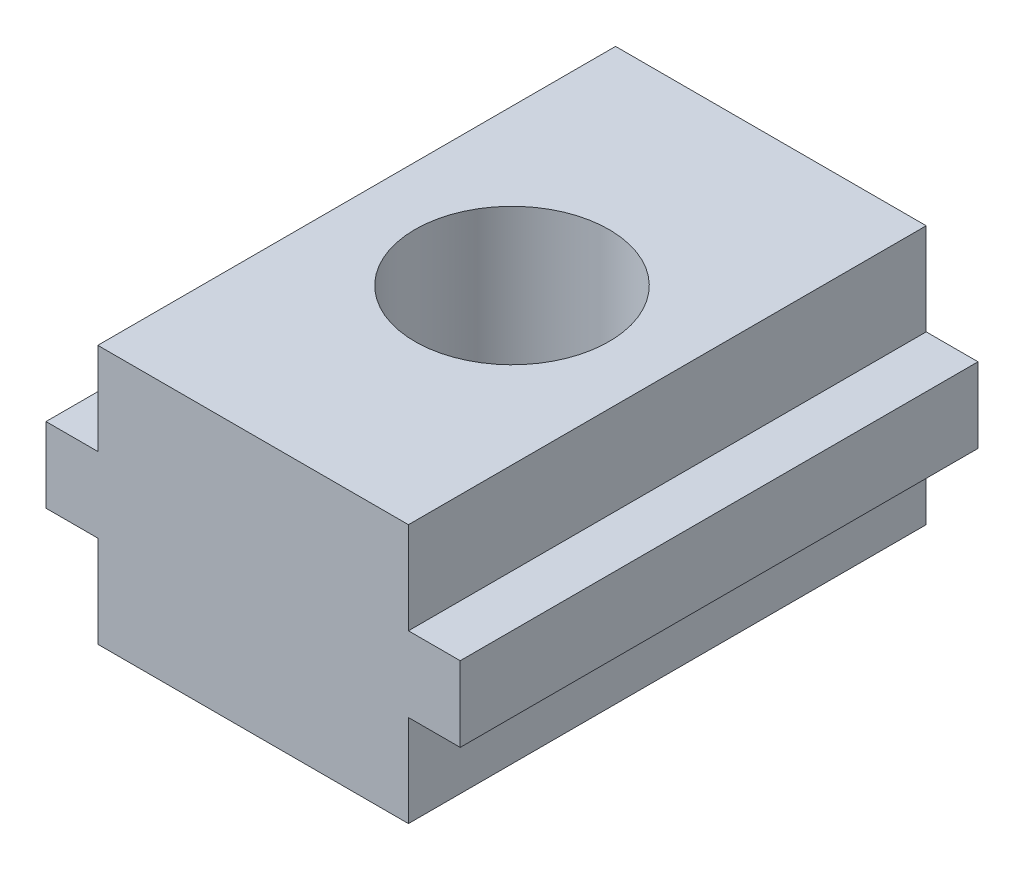
ISO-10303-21;
HEADER;
FILE_DESCRIPTION(('STEP AP214'),'2;1');
FILE_NAME('part.step','',(''),(''),'','','');
FILE_SCHEMA(('AUTOMOTIVE_DESIGN { 1 0 10303 214 1 1 1 1 }'));
ENDSEC;
DATA;
#1=APPLICATION_CONTEXT('core data for automotive mechanical design processes');
#2=APPLICATION_PROTOCOL_DEFINITION('international standard','automotive_design',2000,#1);
#3=PRODUCT_CONTEXT('',#1,'mechanical');
#4=PRODUCT('Part','Part','',(#3));
#5=PRODUCT_RELATED_PRODUCT_CATEGORY('part','',(#4));
#6=PRODUCT_DEFINITION_FORMATION('','',#4);
#7=PRODUCT_DEFINITION_CONTEXT('part definition',#1,'design');
#8=PRODUCT_DEFINITION('design','',#6,#7);
#9=PRODUCT_DEFINITION_SHAPE('','',#8);
#10=(LENGTH_UNIT() NAMED_UNIT(*) SI_UNIT(.MILLI.,.METRE.));
#11=(NAMED_UNIT(*) PLANE_ANGLE_UNIT() SI_UNIT($,.RADIAN.));
#12=(NAMED_UNIT(*) SI_UNIT($,.STERADIAN.) SOLID_ANGLE_UNIT());
#13=UNCERTAINTY_MEASURE_WITH_UNIT(LENGTH_MEASURE(1.E-05),#10,'distance_accuracy_value','');
#14=(GEOMETRIC_REPRESENTATION_CONTEXT(3) GLOBAL_UNCERTAINTY_ASSIGNED_CONTEXT((#13)) GLOBAL_UNIT_ASSIGNED_CONTEXT((#10,
#11,#12)) REPRESENTATION_CONTEXT('',''));
#15=CARTESIAN_POINT('',(0.,0.,0.));
#16=DIRECTION('',(0.,0.,1.));
#17=DIRECTION('',(1.,0.,0.));
#18=AXIS2_PLACEMENT_3D('',#15,#16,#17);
#19=CARTESIAN_POINT('',(6.,10.,10.));
#20=DIRECTION('',(0.,-1.,0.));
#21=DIRECTION('',(1.,0.,0.));
#22=AXIS2_PLACEMENT_3D('',#19,#20,#21);
#23=PLANE('',#22);
#24=CARTESIAN_POINT('',(0.,10.,0.));
#25=DIRECTION('',(0.,1.,0.));
#26=DIRECTION('',(-1.,0.,0.));
#27=AXIS2_PLACEMENT_3D('',#24,#25,#26);
#28=CIRCLE('',#27,3.75);
#29=CARTESIAN_POINT('',(-3.75,10.,0.));
#30=VERTEX_POINT('',#29);
#31=EDGE_CURVE('E261',#30,#30,#28,.T.);
#32=ORIENTED_EDGE('',*,*,#31,.F.);
#33=EDGE_LOOP('',(#32));
#34=FACE_BOUND('',#33,.T.);
#35=DIRECTION('',(-1.,0.,0.));
#36=VECTOR('',#35,1.);
#37=CARTESIAN_POINT('',(6.,10.,-10.));
#38=LINE('',#37,#36);
#39=CARTESIAN_POINT('',(6.,10.,-10.));
#40=VERTEX_POINT('',#39);
#41=CARTESIAN_POINT('',(-6.,10.,-10.));
#42=VERTEX_POINT('',#41);
#43=EDGE_CURVE('E153',#40,#42,#38,.T.);
#44=ORIENTED_EDGE('',*,*,#43,.T.);
#45=DIRECTION('',(0.,0.,-1.));
#46=VECTOR('',#45,1.);
#47=CARTESIAN_POINT('',(-6.,10.,10.));
#48=LINE('',#47,#46);
#49=CARTESIAN_POINT('',(-6.,10.,10.));
#50=VERTEX_POINT('',#49);
#51=EDGE_CURVE('E11',#50,#42,#48,.T.);
#52=ORIENTED_EDGE('',*,*,#51,.F.);
#53=DIRECTION('',(-1.,0.,0.));
#54=VECTOR('',#53,1.);
#55=CARTESIAN_POINT('',(6.,10.,10.));
#56=LINE('',#55,#54);
#57=CARTESIAN_POINT('',(6.,10.,10.));
#58=VERTEX_POINT('',#57);
#59=EDGE_CURVE('E176',#58,#50,#56,.T.);
#60=ORIENTED_EDGE('',*,*,#59,.F.);
#61=DIRECTION('',(0.,0.,-1.));
#62=VECTOR('',#61,1.);
#63=CARTESIAN_POINT('',(6.,10.,10.));
#64=LINE('',#63,#62);
#65=EDGE_CURVE('E149',#58,#40,#64,.T.);
#66=ORIENTED_EDGE('',*,*,#65,.T.);
#67=EDGE_LOOP('',(#44,#52,#60,#66));
#68=FACE_BOUND('',#67,.T.);
#69=ADVANCED_FACE('F33',(#34,#68),#23,.F.);
#70=CARTESIAN_POINT('',(-6.,10.,10.));
#71=DIRECTION('',(1.,0.,0.));
#72=DIRECTION('',(0.,0.,-1.));
#73=AXIS2_PLACEMENT_3D('',#70,#71,#72);
#74=PLANE('',#73);
#75=DIRECTION('',(0.,-1.,0.));
#76=VECTOR('',#75,1.);
#77=CARTESIAN_POINT('',(-6.,10.,-10.));
#78=LINE('',#77,#76);
#79=CARTESIAN_POINT('',(-6.,6.45,-10.));
#80=VERTEX_POINT('',#79);
#81=EDGE_CURVE('E156',#42,#80,#78,.T.);
#82=ORIENTED_EDGE('',*,*,#81,.T.);
#83=DIRECTION('',(0.,0.,-1.));
#84=VECTOR('',#83,1.);
#85=CARTESIAN_POINT('',(-6.,6.45,10.));
#86=LINE('',#85,#84);
#87=CARTESIAN_POINT('',(-6.,6.45,10.));
#88=VERTEX_POINT('',#87);
#89=EDGE_CURVE('E41',#88,#80,#86,.T.);
#90=ORIENTED_EDGE('',*,*,#89,.F.);
#91=DIRECTION('',(0.,-1.,0.));
#92=VECTOR('',#91,1.);
#93=CARTESIAN_POINT('',(-6.,10.,10.));
#94=LINE('',#93,#92);
#95=EDGE_CURVE('E104',#50,#88,#94,.T.);
#96=ORIENTED_EDGE('',*,*,#95,.F.);
#97=ORIENTED_EDGE('',*,*,#51,.T.);
#98=EDGE_LOOP('',(#82,#90,#96,#97));
#99=FACE_BOUND('',#98,.T.);
#100=ADVANCED_FACE('F254',(#99),#74,.F.);
#101=CARTESIAN_POINT('',(-6.,6.45,10.));
#102=DIRECTION('',(0.,-1.,0.));
#103=DIRECTION('',(0.,0.,-1.));
#104=AXIS2_PLACEMENT_3D('',#101,#102,#103);
#105=PLANE('',#104);
#106=DIRECTION('',(-1.,0.,0.));
#107=VECTOR('',#106,1.);
#108=CARTESIAN_POINT('',(-6.,6.45,-10.));
#109=LINE('',#108,#107);
#110=CARTESIAN_POINT('',(-8.,6.45,-10.));
#111=VERTEX_POINT('',#110);
#112=EDGE_CURVE('E159',#80,#111,#109,.T.);
#113=ORIENTED_EDGE('',*,*,#112,.T.);
#114=DIRECTION('',(0.,0.,-1.));
#115=VECTOR('',#114,1.);
#116=CARTESIAN_POINT('',(-8.,6.45,10.));
#117=LINE('',#116,#115);
#118=CARTESIAN_POINT('',(-8.,6.45,10.));
#119=VERTEX_POINT('',#118);
#120=EDGE_CURVE('E195',#119,#111,#117,.T.);
#121=ORIENTED_EDGE('',*,*,#120,.F.);
#122=DIRECTION('',(-1.,0.,0.));
#123=VECTOR('',#122,1.);
#124=CARTESIAN_POINT('',(-6.,6.45,10.));
#125=LINE('',#124,#123);
#126=EDGE_CURVE('E203',#88,#119,#125,.T.);
#127=ORIENTED_EDGE('',*,*,#126,.F.);
#128=ORIENTED_EDGE('',*,*,#89,.T.);
#129=EDGE_LOOP('',(#113,#121,#127,#128));
#130=FACE_BOUND('',#129,.T.);
#131=ADVANCED_FACE('F201',(#130),#105,.F.);
#132=CARTESIAN_POINT('',(-8.,6.45,10.));
#133=DIRECTION('',(1.,0.,0.));
#134=DIRECTION('',(0.,0.,-1.));
#135=AXIS2_PLACEMENT_3D('',#132,#133,#134);
#136=PLANE('',#135);
#137=DIRECTION('',(0.,-1.,0.));
#138=VECTOR('',#137,1.);
#139=CARTESIAN_POINT('',(-8.,6.45,-10.));
#140=LINE('',#139,#138);
#141=CARTESIAN_POINT('',(-8.,3.55,-10.));
#142=VERTEX_POINT('',#141);
#143=EDGE_CURVE('E161',#111,#142,#140,.T.);
#144=ORIENTED_EDGE('',*,*,#143,.T.);
#145=DIRECTION('',(0.,0.,-1.));
#146=VECTOR('',#145,1.);
#147=CARTESIAN_POINT('',(-8.,3.55,10.));
#148=LINE('',#147,#146);
#149=CARTESIAN_POINT('',(-8.,3.55,10.));
#150=VERTEX_POINT('',#149);
#151=EDGE_CURVE('E192',#150,#142,#148,.T.);
#152=ORIENTED_EDGE('',*,*,#151,.F.);
#153=DIRECTION('',(0.,-1.,0.));
#154=VECTOR('',#153,1.);
#155=CARTESIAN_POINT('',(-8.,6.45,10.));
#156=LINE('',#155,#154);
#157=EDGE_CURVE('E221',#119,#150,#156,.T.);
#158=ORIENTED_EDGE('',*,*,#157,.F.);
#159=ORIENTED_EDGE('',*,*,#120,.T.);
#160=EDGE_LOOP('',(#144,#152,#158,#159));
#161=FACE_BOUND('',#160,.T.);
#162=ADVANCED_FACE('F212',(#161),#136,.F.);
#163=CARTESIAN_POINT('',(-8.,3.55,10.));
#164=DIRECTION('',(0.,1.,0.));
#165=DIRECTION('',(0.,0.,1.));
#166=AXIS2_PLACEMENT_3D('',#163,#164,#165);
#167=PLANE('',#166);
#168=DIRECTION('',(1.,0.,0.));
#169=VECTOR('',#168,1.);
#170=CARTESIAN_POINT('',(-8.,3.55,-10.));
#171=LINE('',#170,#169);
#172=CARTESIAN_POINT('',(-6.,3.55,-10.));
#173=VERTEX_POINT('',#172);
#174=EDGE_CURVE('E163',#142,#173,#171,.T.);
#175=ORIENTED_EDGE('',*,*,#174,.T.);
#176=DIRECTION('',(0.,0.,-1.));
#177=VECTOR('',#176,1.);
#178=CARTESIAN_POINT('',(-6.,3.55,10.));
#179=LINE('',#178,#177);
#180=CARTESIAN_POINT('',(-6.,3.55,10.));
#181=VERTEX_POINT('',#180);
#182=EDGE_CURVE('E189',#181,#173,#179,.T.);
#183=ORIENTED_EDGE('',*,*,#182,.F.);
#184=DIRECTION('',(1.,0.,0.));
#185=VECTOR('',#184,1.);
#186=CARTESIAN_POINT('',(-8.,3.55,10.));
#187=LINE('',#186,#185);
#188=EDGE_CURVE('E218',#150,#181,#187,.T.);
#189=ORIENTED_EDGE('',*,*,#188,.F.);
#190=ORIENTED_EDGE('',*,*,#151,.T.);
#191=EDGE_LOOP('',(#175,#183,#189,#190));
#192=FACE_BOUND('',#191,.T.);
#193=ADVANCED_FACE('F216',(#192),#167,.F.);
#194=CARTESIAN_POINT('',(-6.,3.55,10.));
#195=DIRECTION('',(1.,0.,0.));
#196=DIRECTION('',(0.,0.,-1.));
#197=AXIS2_PLACEMENT_3D('',#194,#195,#196);
#198=PLANE('',#197);
#199=DIRECTION('',(0.,-1.,0.));
#200=VECTOR('',#199,1.);
#201=CARTESIAN_POINT('',(-6.,3.55,-10.));
#202=LINE('',#201,#200);
#203=CARTESIAN_POINT('',(-6.,0.,-10.));
#204=VERTEX_POINT('',#203);
#205=EDGE_CURVE('E165',#173,#204,#202,.T.);
#206=ORIENTED_EDGE('',*,*,#205,.T.);
#207=DIRECTION('',(0.,0.,-1.));
#208=VECTOR('',#207,1.);
#209=CARTESIAN_POINT('',(-6.,0.,10.));
#210=LINE('',#209,#208);
#211=CARTESIAN_POINT('',(-6.,0.,10.));
#212=VERTEX_POINT('',#211);
#213=EDGE_CURVE('E186',#212,#204,#210,.T.);
#214=ORIENTED_EDGE('',*,*,#213,.F.);
#215=DIRECTION('',(0.,-1.,0.));
#216=VECTOR('',#215,1.);
#217=CARTESIAN_POINT('',(-6.,3.55,10.));
#218=LINE('',#217,#216);
#219=EDGE_CURVE('E220',#181,#212,#218,.T.);
#220=ORIENTED_EDGE('',*,*,#219,.F.);
#221=ORIENTED_EDGE('',*,*,#182,.T.);
#222=EDGE_LOOP('',(#206,#214,#220,#221));
#223=FACE_BOUND('',#222,.T.);
#224=ADVANCED_FACE('F300',(#223),#198,.F.);
#225=CARTESIAN_POINT('',(-6.,0.,10.));
#226=DIRECTION('',(0.,1.,0.));
#227=DIRECTION('',(-1.,0.,0.));
#228=AXIS2_PLACEMENT_3D('',#225,#226,#227);
#229=PLANE('',#228);
#230=CARTESIAN_POINT('',(0.,0.,0.));
#231=DIRECTION('',(0.,1.,0.));
#232=DIRECTION('',(-1.,0.,0.));
#233=AXIS2_PLACEMENT_3D('',#230,#231,#232);
#234=CIRCLE('',#233,3.);
#235=CARTESIAN_POINT('',(-3.,0.,0.));
#236=VERTEX_POINT('',#235);
#237=EDGE_CURVE('E263',#236,#236,#234,.T.);
#238=ORIENTED_EDGE('',*,*,#237,.T.);
#239=EDGE_LOOP('',(#238));
#240=FACE_BOUND('',#239,.T.);
#241=DIRECTION('',(1.,0.,0.));
#242=VECTOR('',#241,1.);
#243=CARTESIAN_POINT('',(-6.,0.,-10.));
#244=LINE('',#243,#242);
#245=CARTESIAN_POINT('',(6.,0.,-10.));
#246=VERTEX_POINT('',#245);
#247=EDGE_CURVE('E167',#204,#246,#244,.T.);
#248=ORIENTED_EDGE('',*,*,#247,.T.);
#249=DIRECTION('',(0.,0.,-1.));
#250=VECTOR('',#249,1.);
#251=CARTESIAN_POINT('',(6.,0.,10.));
#252=LINE('',#251,#250);
#253=CARTESIAN_POINT('',(6.,0.,10.));
#254=VERTEX_POINT('',#253);
#255=EDGE_CURVE('E183',#254,#246,#252,.T.);
#256=ORIENTED_EDGE('',*,*,#255,.F.);
#257=DIRECTION('',(1.,0.,0.));
#258=VECTOR('',#257,1.);
#259=CARTESIAN_POINT('',(-6.,0.,10.));
#260=LINE('',#259,#258);
#261=EDGE_CURVE('E223',#212,#254,#260,.T.);
#262=ORIENTED_EDGE('',*,*,#261,.F.);
#263=ORIENTED_EDGE('',*,*,#213,.T.);
#264=EDGE_LOOP('',(#248,#256,#262,#263));
#265=FACE_BOUND('',#264,.T.);
#266=ADVANCED_FACE('F297',(#240,#265),#229,.F.);
#267=CARTESIAN_POINT('',(6.,0.,10.));
#268=DIRECTION('',(-1.,0.,0.));
#269=DIRECTION('',(0.,-1.,0.));
#270=AXIS2_PLACEMENT_3D('',#267,#268,#269);
#271=PLANE('',#270);
#272=DIRECTION('',(0.,1.,0.));
#273=VECTOR('',#272,1.);
#274=CARTESIAN_POINT('',(6.,0.,-10.));
#275=LINE('',#274,#273);
#276=CARTESIAN_POINT('',(6.,3.55,-10.));
#277=VERTEX_POINT('',#276);
#278=EDGE_CURVE('E169',#246,#277,#275,.T.);
#279=ORIENTED_EDGE('',*,*,#278,.T.);
#280=DIRECTION('',(0.,0.,-1.));
#281=VECTOR('',#280,1.);
#282=CARTESIAN_POINT('',(6.,3.55,10.));
#283=LINE('',#282,#281);
#284=CARTESIAN_POINT('',(6.,3.55,10.));
#285=VERTEX_POINT('',#284);
#286=EDGE_CURVE('E180',#285,#277,#283,.T.);
#287=ORIENTED_EDGE('',*,*,#286,.F.);
#288=DIRECTION('',(0.,1.,0.));
#289=VECTOR('',#288,1.);
#290=CARTESIAN_POINT('',(6.,0.,10.));
#291=LINE('',#290,#289);
#292=EDGE_CURVE('E229',#254,#285,#291,.T.);
#293=ORIENTED_EDGE('',*,*,#292,.F.);
#294=ORIENTED_EDGE('',*,*,#255,.T.);
#295=EDGE_LOOP('',(#279,#287,#293,#294));
#296=FACE_BOUND('',#295,.T.);
#297=ADVANCED_FACE('F235',(#296),#271,.F.);
#298=CARTESIAN_POINT('',(6.,3.55,10.));
#299=DIRECTION('',(0.,1.,0.));
#300=DIRECTION('',(-1.,0.,0.));
#301=AXIS2_PLACEMENT_3D('',#298,#299,#300);
#302=PLANE('',#301);
#303=DIRECTION('',(1.,0.,0.));
#304=VECTOR('',#303,1.);
#305=CARTESIAN_POINT('',(6.,3.55,-10.));
#306=LINE('',#305,#304);
#307=CARTESIAN_POINT('',(8.,3.55,-10.));
#308=VERTEX_POINT('',#307);
#309=EDGE_CURVE('E171',#277,#308,#306,.T.);
#310=ORIENTED_EDGE('',*,*,#309,.T.);
#311=DIRECTION('',(0.,0.,-1.));
#312=VECTOR('',#311,1.);
#313=CARTESIAN_POINT('',(8.,3.55,10.));
#314=LINE('',#313,#312);
#315=CARTESIAN_POINT('',(8.,3.55,10.));
#316=VERTEX_POINT('',#315);
#317=EDGE_CURVE('E144',#316,#308,#314,.T.);
#318=ORIENTED_EDGE('',*,*,#317,.F.);
#319=DIRECTION('',(1.,0.,0.));
#320=VECTOR('',#319,1.);
#321=CARTESIAN_POINT('',(6.,3.55,10.));
#322=LINE('',#321,#320);
#323=EDGE_CURVE('E135',#285,#316,#322,.T.);
#324=ORIENTED_EDGE('',*,*,#323,.F.);
#325=ORIENTED_EDGE('',*,*,#286,.T.);
#326=EDGE_LOOP('',(#310,#318,#324,#325));
#327=FACE_BOUND('',#326,.T.);
#328=ADVANCED_FACE('F239',(#327),#302,.F.);
#329=CARTESIAN_POINT('',(8.,3.55,10.));
#330=DIRECTION('',(-1.,0.,0.));
#331=DIRECTION('',(0.,-1.,0.));
#332=AXIS2_PLACEMENT_3D('',#329,#330,#331);
#333=PLANE('',#332);
#334=DIRECTION('',(0.,1.,0.));
#335=VECTOR('',#334,1.);
#336=CARTESIAN_POINT('',(8.,3.55,-10.));
#337=LINE('',#336,#335);
#338=CARTESIAN_POINT('',(8.,6.45,-10.));
#339=VERTEX_POINT('',#338);
#340=EDGE_CURVE('E143',#308,#339,#337,.T.);
#341=ORIENTED_EDGE('',*,*,#340,.T.);
#342=DIRECTION('',(0.,0.,-1.));
#343=VECTOR('',#342,1.);
#344=CARTESIAN_POINT('',(8.,6.45,10.));
#345=LINE('',#344,#343);
#346=CARTESIAN_POINT('',(8.,6.45,10.));
#347=VERTEX_POINT('',#346);
#348=EDGE_CURVE('E140',#347,#339,#345,.T.);
#349=ORIENTED_EDGE('',*,*,#348,.F.);
#350=DIRECTION('',(0.,1.,0.));
#351=VECTOR('',#350,1.);
#352=CARTESIAN_POINT('',(8.,3.55,10.));
#353=LINE('',#352,#351);
#354=EDGE_CURVE('E129',#316,#347,#353,.T.);
#355=ORIENTED_EDGE('',*,*,#354,.F.);
#356=ORIENTED_EDGE('',*,*,#317,.T.);
#357=EDGE_LOOP('',(#341,#349,#355,#356));
#358=FACE_BOUND('',#357,.T.);
#359=ADVANCED_FACE('F141',(#358),#333,.F.);
#360=CARTESIAN_POINT('',(8.,6.45,10.));
#361=DIRECTION('',(0.,-1.,0.));
#362=DIRECTION('',(0.,0.,-1.));
#363=AXIS2_PLACEMENT_3D('',#360,#361,#362);
#364=PLANE('',#363);
#365=DIRECTION('',(-1.,0.,0.));
#366=VECTOR('',#365,1.);
#367=CARTESIAN_POINT('',(8.,6.45,-10.));
#368=LINE('',#367,#366);
#369=CARTESIAN_POINT('',(6.,6.45,-10.));
#370=VERTEX_POINT('',#369);
#371=EDGE_CURVE('E90',#339,#370,#368,.T.);
#372=ORIENTED_EDGE('',*,*,#371,.T.);
#373=DIRECTION('',(0.,0.,-1.));
#374=VECTOR('',#373,1.);
#375=CARTESIAN_POINT('',(6.,6.45,10.));
#376=LINE('',#375,#374);
#377=CARTESIAN_POINT('',(6.,6.45,10.));
#378=VERTEX_POINT('',#377);
#379=EDGE_CURVE('E145',#378,#370,#376,.T.);
#380=ORIENTED_EDGE('',*,*,#379,.F.);
#381=DIRECTION('',(-1.,0.,0.));
#382=VECTOR('',#381,1.);
#383=CARTESIAN_POINT('',(8.,6.45,10.));
#384=LINE('',#383,#382);
#385=EDGE_CURVE('E133',#347,#378,#384,.T.);
#386=ORIENTED_EDGE('',*,*,#385,.F.);
#387=ORIENTED_EDGE('',*,*,#348,.T.);
#388=EDGE_LOOP('',(#372,#380,#386,#387));
#389=FACE_BOUND('',#388,.T.);
#390=ADVANCED_FACE('F147',(#389),#364,.F.);
#391=CARTESIAN_POINT('',(6.,6.45,10.));
#392=DIRECTION('',(-1.,0.,0.));
#393=DIRECTION('',(0.,-1.,0.));
#394=AXIS2_PLACEMENT_3D('',#391,#392,#393);
#395=PLANE('',#394);
#396=DIRECTION('',(0.,1.,0.));
#397=VECTOR('',#396,1.);
#398=CARTESIAN_POINT('',(6.,6.45,-10.));
#399=LINE('',#398,#397);
#400=EDGE_CURVE('E96',#370,#40,#399,.T.);
#401=ORIENTED_EDGE('',*,*,#400,.T.);
#402=ORIENTED_EDGE('',*,*,#65,.F.);
#403=DIRECTION('',(0.,1.,0.));
#404=VECTOR('',#403,1.);
#405=CARTESIAN_POINT('',(6.,6.45,10.));
#406=LINE('',#405,#404);
#407=EDGE_CURVE('E49',#378,#58,#406,.T.);
#408=ORIENTED_EDGE('',*,*,#407,.F.);
#409=ORIENTED_EDGE('',*,*,#379,.T.);
#410=EDGE_LOOP('',(#401,#402,#408,#409));
#411=FACE_BOUND('',#410,.T.);
#412=ADVANCED_FACE('F243',(#411),#395,.F.);
#413=CARTESIAN_POINT('',(0.,0.,10.));
#414=DIRECTION('',(0.,0.,1.));
#415=DIRECTION('',(1.,0.,0.));
#416=AXIS2_PLACEMENT_3D('',#413,#414,#415);
#417=PLANE('',#416);
#418=ORIENTED_EDGE('',*,*,#59,.T.);
#419=ORIENTED_EDGE('',*,*,#95,.T.);
#420=ORIENTED_EDGE('',*,*,#126,.T.);
#421=ORIENTED_EDGE('',*,*,#157,.T.);
#422=ORIENTED_EDGE('',*,*,#188,.T.);
#423=ORIENTED_EDGE('',*,*,#219,.T.);
#424=ORIENTED_EDGE('',*,*,#261,.T.);
#425=ORIENTED_EDGE('',*,*,#292,.T.);
#426=ORIENTED_EDGE('',*,*,#323,.T.);
#427=ORIENTED_EDGE('',*,*,#354,.T.);
#428=ORIENTED_EDGE('',*,*,#385,.T.);
#429=ORIENTED_EDGE('',*,*,#407,.T.);
#430=EDGE_LOOP('',(#418,#419,#420,#421,#422,#423,#424,#425,#426,#427,#428,#429));
#431=FACE_BOUND('',#430,.T.);
#432=ADVANCED_FACE('F131',(#431),#417,.T.);
#433=CARTESIAN_POINT('',(0.,0.,-10.));
#434=DIRECTION('',(0.,0.,1.));
#435=DIRECTION('',(1.,0.,0.));
#436=AXIS2_PLACEMENT_3D('',#433,#434,#435);
#437=PLANE('',#436);
#438=ORIENTED_EDGE('',*,*,#43,.F.);
#439=ORIENTED_EDGE('',*,*,#400,.F.);
#440=ORIENTED_EDGE('',*,*,#371,.F.);
#441=ORIENTED_EDGE('',*,*,#340,.F.);
#442=ORIENTED_EDGE('',*,*,#309,.F.);
#443=ORIENTED_EDGE('',*,*,#278,.F.);
#444=ORIENTED_EDGE('',*,*,#247,.F.);
#445=ORIENTED_EDGE('',*,*,#205,.F.);
#446=ORIENTED_EDGE('',*,*,#174,.F.);
#447=ORIENTED_EDGE('',*,*,#143,.F.);
#448=ORIENTED_EDGE('',*,*,#112,.F.);
#449=ORIENTED_EDGE('',*,*,#81,.F.);
#450=EDGE_LOOP('',(#438,#439,#440,#441,#442,#443,#444,#445,#446,#447,#448,#449));
#451=FACE_BOUND('',#450,.T.);
#452=ADVANCED_FACE('F207',(#451),#437,.F.);
#453=CARTESIAN_POINT('',(0.,2.,0.));
#454=DIRECTION('',(0.,1.,0.));
#455=DIRECTION('',(-1.,0.,0.));
#456=AXIS2_PLACEMENT_3D('',#453,#454,#455);
#457=CYLINDRICAL_SURFACE('',#456,3.75);
#458=CARTESIAN_POINT('',(0.,2.,0.));
#459=DIRECTION('',(0.,1.,0.));
#460=DIRECTION('',(-1.,0.,0.));
#461=AXIS2_PLACEMENT_3D('',#458,#459,#460);
#462=CIRCLE('',#461,3.75);
#463=CARTESIAN_POINT('',(-3.75,2.,0.));
#464=VERTEX_POINT('',#463);
#465=EDGE_CURVE('E157',#464,#464,#462,.T.);
#466=ORIENTED_EDGE('',*,*,#465,.F.);
#467=EDGE_LOOP('',(#466));
#468=FACE_BOUND('',#467,.T.);
#469=ORIENTED_EDGE('',*,*,#31,.T.);
#470=EDGE_LOOP('',(#469));
#471=FACE_BOUND('',#470,.T.);
#472=ADVANCED_FACE('F281',(#468,#471),#457,.F.);
#473=CARTESIAN_POINT('',(0.,2.,0.));
#474=DIRECTION('',(0.,1.,0.));
#475=DIRECTION('',(-1.,0.,0.));
#476=AXIS2_PLACEMENT_3D('',#473,#474,#475);
#477=PLANE('',#476);
#478=CARTESIAN_POINT('',(0.,2.,0.));
#479=DIRECTION('',(0.,1.,0.));
#480=DIRECTION('',(-1.,0.,0.));
#481=AXIS2_PLACEMENT_3D('',#478,#479,#480);
#482=CIRCLE('',#481,3.);
#483=CARTESIAN_POINT('',(-3.,2.,0.));
#484=VERTEX_POINT('',#483);
#485=EDGE_CURVE('E268',#484,#484,#482,.T.);
#486=ORIENTED_EDGE('',*,*,#485,.F.);
#487=EDGE_LOOP('',(#486));
#488=FACE_BOUND('',#487,.T.);
#489=ORIENTED_EDGE('',*,*,#465,.T.);
#490=EDGE_LOOP('',(#489));
#491=FACE_BOUND('',#490,.T.);
#492=ADVANCED_FACE('F278',(#488,#491),#477,.T.);
#493=CARTESIAN_POINT('',(0.,0.,0.));
#494=DIRECTION('',(0.,1.,0.));
#495=DIRECTION('',(-1.,0.,0.));
#496=AXIS2_PLACEMENT_3D('',#493,#494,#495);
#497=CYLINDRICAL_SURFACE('',#496,3.);
#498=ORIENTED_EDGE('',*,*,#237,.F.);
#499=EDGE_LOOP('',(#498));
#500=FACE_BOUND('',#499,.T.);
#501=ORIENTED_EDGE('',*,*,#485,.T.);
#502=EDGE_LOOP('',(#501));
#503=FACE_BOUND('',#502,.T.);
#504=ADVANCED_FACE('F276',(#500,#503),#497,.F.);
#505=CLOSED_SHELL('',(#69,#100,#131,#162,#193,#224,#266,#297,#328,#359,#390,#412,#432,#452,#472,
#492,#504));
#506=MANIFOLD_SOLID_BREP('B2',#505);
#507=ADVANCED_BREP_SHAPE_REPRESENTATION('',(#18,#506),#14);
#508=SHAPE_DEFINITION_REPRESENTATION(#9,#507);
ENDSEC;
END-ISO-10303-21;
